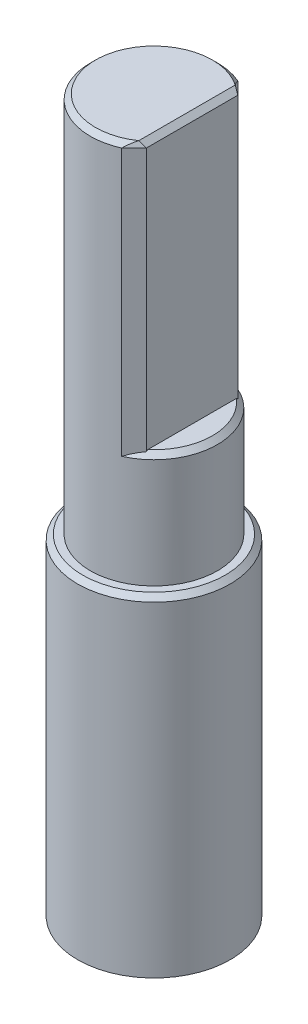
ISO-10303-21;
HEADER;
FILE_DESCRIPTION(('STEP AP214'),'2;1');
FILE_NAME('part.step','',(''),(''),'','','');
FILE_SCHEMA(('AUTOMOTIVE_DESIGN { 1 0 10303 214 1 1 1 1 }'));
ENDSEC;
DATA;
#1=APPLICATION_CONTEXT('core data for automotive mechanical design processes');
#2=APPLICATION_PROTOCOL_DEFINITION('international standard','automotive_design',2000,#1);
#3=PRODUCT_CONTEXT('',#1,'mechanical');
#4=PRODUCT('Part','Part','',(#3));
#5=PRODUCT_RELATED_PRODUCT_CATEGORY('part','',(#4));
#6=PRODUCT_DEFINITION_FORMATION('','',#4);
#7=PRODUCT_DEFINITION_CONTEXT('part definition',#1,'design');
#8=PRODUCT_DEFINITION('design','',#6,#7);
#9=PRODUCT_DEFINITION_SHAPE('','',#8);
#10=(LENGTH_UNIT() NAMED_UNIT(*) SI_UNIT(.MILLI.,.METRE.));
#11=(NAMED_UNIT(*) PLANE_ANGLE_UNIT() SI_UNIT($,.RADIAN.));
#12=(NAMED_UNIT(*) SI_UNIT($,.STERADIAN.) SOLID_ANGLE_UNIT());
#13=UNCERTAINTY_MEASURE_WITH_UNIT(LENGTH_MEASURE(1.E-05),#10,'distance_accuracy_value','');
#14=(GEOMETRIC_REPRESENTATION_CONTEXT(3) GLOBAL_UNCERTAINTY_ASSIGNED_CONTEXT((#13)) GLOBAL_UNIT_ASSIGNED_CONTEXT((#10,
#11,#12)) REPRESENTATION_CONTEXT('',''));
#15=CARTESIAN_POINT('',(0.,0.,0.));
#16=DIRECTION('',(0.,0.,1.));
#17=DIRECTION('',(1.,0.,0.));
#18=AXIS2_PLACEMENT_3D('',#15,#16,#17);
#19=CARTESIAN_POINT('',(0.,-10.,0.));
#20=DIRECTION('',(0.,1.,0.));
#21=DIRECTION('',(0.,0.,1.));
#22=AXIS2_PLACEMENT_3D('',#19,#20,#21);
#23=CYLINDRICAL_SURFACE('',#22,3.);
#24=CARTESIAN_POINT('',(0.,2.8,0.));
#25=DIRECTION('',(0.,1.,0.));
#26=DIRECTION('',(0.,0.,1.));
#27=AXIS2_PLACEMENT_3D('',#24,#25,#26);
#28=CIRCLE('',#27,3.);
#29=CARTESIAN_POINT('',(0.,2.8,3.));
#30=VERTEX_POINT('',#29);
#31=EDGE_CURVE('E105',#30,#30,#28,.F.);
#32=ORIENTED_EDGE('',*,*,#31,.T.);
#33=EDGE_LOOP('',(#32));
#34=FACE_BOUND('',#33,.T.);
#35=CARTESIAN_POINT('',(0.,-10.,0.));
#36=DIRECTION('',(0.,1.,0.));
#37=DIRECTION('',(0.,0.,1.));
#38=AXIS2_PLACEMENT_3D('',#35,#36,#37);
#39=CIRCLE('',#38,3.);
#40=CARTESIAN_POINT('',(0.,-10.,3.));
#41=VERTEX_POINT('',#40);
#42=EDGE_CURVE('E108',#41,#41,#39,.T.);
#43=ORIENTED_EDGE('',*,*,#42,.T.);
#44=EDGE_LOOP('',(#43));
#45=FACE_BOUND('',#44,.T.);
#46=ADVANCED_FACE('F32',(#34,#45),#23,.T.);
#47=CARTESIAN_POINT('',(0.,-10.,0.));
#48=DIRECTION('',(0.,1.,0.));
#49=DIRECTION('',(0.,0.,1.));
#50=AXIS2_PLACEMENT_3D('',#47,#48,#49);
#51=PLANE('',#50);
#52=ORIENTED_EDGE('',*,*,#42,.F.);
#53=EDGE_LOOP('',(#52));
#54=FACE_BOUND('',#53,.T.);
#55=ADVANCED_FACE('F221',(#54),#51,.F.);
#56=CARTESIAN_POINT('',(0.,3.,0.));
#57=DIRECTION('',(0.,1.,0.));
#58=DIRECTION('',(0.,0.,1.));
#59=AXIS2_PLACEMENT_3D('',#56,#57,#58);
#60=CYLINDRICAL_SURFACE('',#59,2.5);
#61=DIRECTION('',(0.,1.,0.));
#62=VECTOR('',#61,1.);
#63=CARTESIAN_POINT('',(1.01557112297752,3.,-2.28442887702248));
#64=LINE('',#63,#62);
#65=CARTESIAN_POINT('',(1.01557112297752,17.8,-2.28442887702248));
#66=VERTEX_POINT('',#65);
#67=CARTESIAN_POINT('',(1.01557112297752,7.3,-2.28442887702248));
#68=VERTEX_POINT('',#67);
#69=EDGE_CURVE('E124',#66,#68,#64,.F.);
#70=ORIENTED_EDGE('',*,*,#69,.T.);
#71=CARTESIAN_POINT('',(0.,7.3,0.));
#72=DIRECTION('',(0.,1.,0.));
#73=DIRECTION('',(0.,0.,1.));
#74=AXIS2_PLACEMENT_3D('',#71,#72,#73);
#75=CIRCLE('',#74,2.5);
#76=CARTESIAN_POINT('',(1.01557112297752,7.3,2.28442887702248));
#77=VERTEX_POINT('',#76);
#78=EDGE_CURVE('E126',#68,#77,#75,.F.);
#79=ORIENTED_EDGE('',*,*,#78,.T.);
#80=DIRECTION('',(0.,1.,0.));
#81=VECTOR('',#80,1.);
#82=CARTESIAN_POINT('',(1.01557112297752,3.,2.28442887702248));
#83=LINE('',#82,#81);
#84=CARTESIAN_POINT('',(1.01557112297752,17.8,2.28442887702248));
#85=VERTEX_POINT('',#84);
#86=EDGE_CURVE('E122',#77,#85,#83,.T.);
#87=ORIENTED_EDGE('',*,*,#86,.T.);
#88=CARTESIAN_POINT('',(0.,17.8,0.));
#89=DIRECTION('',(0.,1.,0.));
#90=DIRECTION('',(0.,0.,1.));
#91=AXIS2_PLACEMENT_3D('',#88,#89,#90);
#92=CIRCLE('',#91,2.5);
#93=EDGE_CURVE('E104',#85,#66,#92,.F.);
#94=ORIENTED_EDGE('',*,*,#93,.T.);
#95=EDGE_LOOP('',(#70,#79,#87,#94));
#96=FACE_BOUND('',#95,.T.);
#97=CARTESIAN_POINT('',(0.,3.,0.));
#98=DIRECTION('',(0.,1.,0.));
#99=DIRECTION('',(0.,0.,1.));
#100=AXIS2_PLACEMENT_3D('',#97,#98,#99);
#101=CIRCLE('',#100,2.5);
#102=CARTESIAN_POINT('',(0.,3.,2.5));
#103=VERTEX_POINT('',#102);
#104=EDGE_CURVE('E109',#103,#103,#101,.T.);
#105=ORIENTED_EDGE('',*,*,#104,.T.);
#106=EDGE_LOOP('',(#105));
#107=FACE_BOUND('',#106,.T.);
#108=ADVANCED_FACE('F226',(#96,#107),#60,.T.);
#109=CARTESIAN_POINT('',(0.,3.,0.));
#110=DIRECTION('',(0.,1.,0.));
#111=DIRECTION('',(0.,0.,1.));
#112=AXIS2_PLACEMENT_3D('',#109,#110,#111);
#113=PLANE('',#112);
#114=CARTESIAN_POINT('',(0.,3.,0.));
#115=DIRECTION('',(0.,1.,0.));
#116=DIRECTION('',(0.,0.,1.));
#117=AXIS2_PLACEMENT_3D('',#114,#115,#116);
#118=CIRCLE('',#117,2.8);
#119=CARTESIAN_POINT('',(0.,3.,2.8));
#120=VERTEX_POINT('',#119);
#121=EDGE_CURVE('E112',#120,#120,#118,.T.);
#122=ORIENTED_EDGE('',*,*,#121,.T.);
#123=EDGE_LOOP('',(#122));
#124=FACE_BOUND('',#123,.T.);
#125=ORIENTED_EDGE('',*,*,#104,.F.);
#126=EDGE_LOOP('',(#125));
#127=FACE_BOUND('',#126,.T.);
#128=ADVANCED_FACE('F234',(#124,#127),#113,.T.);
#129=CARTESIAN_POINT('',(0.,7.5,0.));
#130=DIRECTION('',(0.,1.,0.));
#131=DIRECTION('',(0.,0.,1.));
#132=AXIS2_PLACEMENT_3D('',#129,#130,#131);
#133=PLANE('',#132);
#134=DIRECTION('',(0.,0.,1.));
#135=VECTOR('',#134,1.);
#136=CARTESIAN_POINT('',(1.5,7.5,-3.));
#137=LINE('',#136,#135);
#138=CARTESIAN_POINT('',(1.5,7.5,-1.74355957741627));
#139=VERTEX_POINT('',#138);
#140=CARTESIAN_POINT('',(1.5,7.5,1.74355957741627));
#141=VERTEX_POINT('',#140);
#142=EDGE_CURVE('E103',#139,#141,#137,.T.);
#143=ORIENTED_EDGE('',*,*,#142,.T.);
#144=CARTESIAN_POINT('',(0.,7.5,0.));
#145=DIRECTION('',(0.,1.,0.));
#146=DIRECTION('',(0.,0.,1.));
#147=AXIS2_PLACEMENT_3D('',#144,#145,#146);
#148=CIRCLE('',#147,2.3);
#149=EDGE_CURVE('E94',#141,#139,#148,.T.);
#150=ORIENTED_EDGE('',*,*,#149,.T.);
#151=EDGE_LOOP('',(#143,#150));
#152=FACE_BOUND('',#151,.T.);
#153=ADVANCED_FACE('F102',(#152),#133,.T.);
#154=CARTESIAN_POINT('',(1.5,7.5,-3.));
#155=DIRECTION('',(-1.,0.,0.));
#156=DIRECTION('',(0.,0.,1.));
#157=AXIS2_PLACEMENT_3D('',#154,#155,#156);
#158=PLANE('',#157);
#159=CARTESIAN_POINT('',(1.5,7.5,-1.74355957741627));
#160=CARTESIAN_POINT('',(1.5,7.49285102019159,-1.75298934088291));
#161=CARTESIAN_POINT('',(1.5,7.48568695497038,-1.76240759127683));
#162=CARTESIAN_POINT('',(1.5,7.47132865404493,-1.78122106547032));
#163=CARTESIAN_POINT('',(1.5,7.46413441834213,-1.79061628927099));
#164=CARTESIAN_POINT('',(1.5,7.45692509722797,-1.80000000000004));
#165=B_SPLINE_CURVE_WITH_KNOTS('',3,(#159,#160,#161,#162,#163,#164),.UNSPECIFIED.,.F.,.F.,(4,2,
4),(0.,0.0354999357574972,0.0709998698209496),.UNSPECIFIED.);
#166=CARTESIAN_POINT('',(1.5,7.45692509722797,-1.80000000000004));
#167=VERTEX_POINT('',#166);
#168=EDGE_CURVE('E45',#139,#167,#165,.T.);
#169=ORIENTED_EDGE('',*,*,#168,.T.);
#170=DIRECTION('',(0.,1.,0.));
#171=VECTOR('',#170,1.);
#172=CARTESIAN_POINT('',(1.5,18.,-1.80000000000004));
#173=LINE('',#172,#171);
#174=CARTESIAN_POINT('',(1.5,17.8,-1.80000000000004));
#175=VERTEX_POINT('',#174);
#176=EDGE_CURVE('E60',#167,#175,#173,.T.);
#177=ORIENTED_EDGE('',*,*,#176,.T.);
#178=DIRECTION('',(0.,0.,1.));
#179=VECTOR('',#178,1.);
#180=CARTESIAN_POINT('',(1.5,17.8,2.));
#181=LINE('',#180,#179);
#182=CARTESIAN_POINT('',(1.5,17.8,1.80000000000004));
#183=VERTEX_POINT('',#182);
#184=EDGE_CURVE('E129',#175,#183,#181,.T.);
#185=ORIENTED_EDGE('',*,*,#184,.T.);
#186=DIRECTION('',(0.,-1.,0.));
#187=VECTOR('',#186,1.);
#188=CARTESIAN_POINT('',(1.5,7.5,1.80000000000004));
#189=LINE('',#188,#187);
#190=CARTESIAN_POINT('',(1.5,7.45692509722797,1.80000000000004));
#191=VERTEX_POINT('',#190);
#192=EDGE_CURVE('E52',#183,#191,#189,.T.);
#193=ORIENTED_EDGE('',*,*,#192,.T.);
#194=CARTESIAN_POINT('',(1.5,7.45692509722797,1.80000000000004));
#195=CARTESIAN_POINT('',(1.5,7.46413441834213,1.79061628927099));
#196=CARTESIAN_POINT('',(1.5,7.47132865404493,1.78122106547032));
#197=CARTESIAN_POINT('',(1.5,7.48568695497038,1.76240759127683));
#198=CARTESIAN_POINT('',(1.5,7.49285102019159,1.75298934088291));
#199=CARTESIAN_POINT('',(1.5,7.5,1.74355957741627));
#200=B_SPLINE_CURVE_WITH_KNOTS('',3,(#194,#195,#196,#197,#198,#199),.UNSPECIFIED.,.F.,.F.,(4,2,
4),(0.,0.0354999340634524,0.0709998698209498),.UNSPECIFIED.);
#201=EDGE_CURVE('E11',#191,#141,#200,.T.);
#202=ORIENTED_EDGE('',*,*,#201,.T.);
#203=ORIENTED_EDGE('',*,*,#142,.F.);
#204=EDGE_LOOP('',(#169,#177,#185,#193,#202,#203));
#205=FACE_BOUND('',#204,.T.);
#206=ADVANCED_FACE('F107',(#205),#158,.F.);
#207=CARTESIAN_POINT('',(0.,18.,0.));
#208=DIRECTION('',(0.,1.,0.));
#209=DIRECTION('',(0.,0.,1.));
#210=AXIS2_PLACEMENT_3D('',#207,#208,#209);
#211=PLANE('',#210);
#212=CARTESIAN_POINT('',(0.,18.,0.));
#213=DIRECTION('',(0.,1.,0.));
#214=DIRECTION('',(0.,0.,1.));
#215=AXIS2_PLACEMENT_3D('',#212,#213,#214);
#216=CIRCLE('',#215,2.3);
#217=CARTESIAN_POINT('',(1.29999999999999,18.,-1.89736659610104));
#218=VERTEX_POINT('',#217);
#219=CARTESIAN_POINT('',(1.29999999999999,18.,1.89736659610104));
#220=VERTEX_POINT('',#219);
#221=EDGE_CURVE('E133',#218,#220,#216,.T.);
#222=ORIENTED_EDGE('',*,*,#221,.T.);
#223=DIRECTION('',(0.,0.,-1.));
#224=VECTOR('',#223,1.);
#225=CARTESIAN_POINT('',(1.3,18.,-2.));
#226=LINE('',#225,#224);
#227=EDGE_CURVE('E98',#220,#218,#226,.T.);
#228=ORIENTED_EDGE('',*,*,#227,.T.);
#229=EDGE_LOOP('',(#222,#228));
#230=FACE_BOUND('',#229,.T.);
#231=ADVANCED_FACE('F212',(#230),#211,.T.);
#232=CARTESIAN_POINT('',(0.,3.,0.));
#233=DIRECTION('',(0.,-1.,0.));
#234=DIRECTION('',(0.,0.,-1.));
#235=AXIS2_PLACEMENT_3D('',#232,#233,#234);
#236=CONICAL_SURFACE('',#235,2.8,0.785398163397452);
#237=ORIENTED_EDGE('',*,*,#31,.F.);
#238=EDGE_LOOP('',(#237));
#239=FACE_BOUND('',#238,.T.);
#240=ORIENTED_EDGE('',*,*,#121,.F.);
#241=EDGE_LOOP('',(#240));
#242=FACE_BOUND('',#241,.T.);
#243=ADVANCED_FACE('F153',(#239,#242),#236,.T.);
#244=CARTESIAN_POINT('',(1.5,17.8,-3.));
#245=DIRECTION('',(0.707106781186545,0.70710678118655,0.));
#246=DIRECTION('',(0.,0.,-1.));
#247=AXIS2_PLACEMENT_3D('',#244,#245,#246);
#248=PLANE('',#247);
#249=DIRECTION('',(0.668600029572011,-0.668600029572006,0.325496545162339));
#250=VECTOR('',#249,1.);
#251=CARTESIAN_POINT('',(1.5,17.8,-1.80000000000004));
#252=LINE('',#251,#250);
#253=EDGE_CURVE('E189',#218,#175,#252,.T.);
#254=ORIENTED_EDGE('',*,*,#253,.F.);
#255=ORIENTED_EDGE('',*,*,#227,.F.);
#256=DIRECTION('',(-0.668600029572035,0.668600029572031,0.325496545162239));
#257=VECTOR('',#256,1.);
#258=CARTESIAN_POINT('',(1.17802289395654,18.1219771060435,1.95674907418953));
#259=LINE('',#258,#257);
#260=EDGE_CURVE('E192',#183,#220,#259,.T.);
#261=ORIENTED_EDGE('',*,*,#260,.F.);
#262=ORIENTED_EDGE('',*,*,#184,.F.);
#263=EDGE_LOOP('',(#254,#255,#261,#262));
#264=FACE_BOUND('',#263,.T.);
#265=ADVANCED_FACE('F34',(#264),#248,.T.);
#266=CARTESIAN_POINT('',(0.,18.,0.));
#267=DIRECTION('',(0.,-1.,0.));
#268=DIRECTION('',(0.,0.,-1.));
#269=AXIS2_PLACEMENT_3D('',#266,#267,#268);
#270=CONICAL_SURFACE('',#269,2.3,0.785398163397451);
#271=CARTESIAN_POINT('',(1.29999999999999,18.,1.89736659610104));
#272=CARTESIAN_POINT('',(1.27358480107502,17.9881006901367,1.92988812840262));
#273=CARTESIAN_POINT('',(1.24791377876603,17.9747155052516,1.96242798614447));
#274=CARTESIAN_POINT('',(1.19803029707093,17.9454582065731,2.0273253486009));
#275=CARTESIAN_POINT('',(1.17381338685574,17.9295942801266,2.0596831026681));
#276=CARTESIAN_POINT('',(1.12665130027284,17.895790573377,2.12419213669156));
#277=CARTESIAN_POINT('',(1.10370545850435,17.8778518946836,2.15634351673886));
#278=CARTESIAN_POINT('',(1.0588625554512,17.8401784718905,2.22051917788087));
#279=CARTESIAN_POINT('',(1.03696913768228,17.820438090413,2.25254270837631));
#280=CARTESIAN_POINT('',(1.01557112297752,17.8,2.28442887702248));
#281=B_SPLINE_CURVE_WITH_KNOTS('',3,(#271,#272,#273,#274,#275,#276,#277,#278,#279,#280),
.UNSPECIFIED.,.F.,.F.,(4,2,2,2,4),(0.,0.130586978509166,0.260751403967073,0.390847031935366,
0.521364668445721),.UNSPECIFIED.);
#282=EDGE_CURVE('E36',#220,#85,#281,.T.);
#283=ORIENTED_EDGE('',*,*,#282,.F.);
#284=ORIENTED_EDGE('',*,*,#221,.F.);
#285=CARTESIAN_POINT('',(1.01557112297752,17.8,-2.28442887702248));
#286=CARTESIAN_POINT('',(1.03696913768228,17.820438090413,-2.25254270837631));
#287=CARTESIAN_POINT('',(1.0588625554512,17.8401784718905,-2.22051917788088));
#288=CARTESIAN_POINT('',(1.10370545850436,17.8778518946835,-2.15634351673886));
#289=CARTESIAN_POINT('',(1.12665130027286,17.895790573377,-2.12419213669156));
#290=CARTESIAN_POINT('',(1.17381338685576,17.9295942801266,-2.05968310266811));
#291=CARTESIAN_POINT('',(1.19803029707096,17.945458206573,-2.02732534860091));
#292=CARTESIAN_POINT('',(1.24791377876606,17.9747155052516,-1.96242798614447));
#293=CARTESIAN_POINT('',(1.27358480107506,17.9881006901366,-1.92988812840263));
#294=CARTESIAN_POINT('',(1.30000000000003,18.,-1.89736659610105));
#295=B_SPLINE_CURVE_WITH_KNOTS('',3,(#285,#286,#287,#288,#289,#290,#291,#292,#293,#294),
.UNSPECIFIED.,.F.,.F.,(4,2,2,2,4),(0.,0.130517636510357,0.26061326447865,0.390777689936557,
0.521364668445726),.UNSPECIFIED.);
#296=EDGE_CURVE('E184',#66,#218,#295,.T.);
#297=ORIENTED_EDGE('',*,*,#296,.F.);
#298=ORIENTED_EDGE('',*,*,#93,.F.);
#299=EDGE_LOOP('',(#283,#284,#297,#298));
#300=FACE_BOUND('',#299,.T.);
#301=ADVANCED_FACE('F181',(#300),#270,.T.);
#302=CARTESIAN_POINT('',(1.01557112297752,17.8,2.28442887702248));
#303=DIRECTION('',(0.664699057853721,0.341101634379946,0.664699057853782));
#304=DIRECTION('',(0.70710678118658,0.,-0.707106781186515));
#305=AXIS2_PLACEMENT_3D('',#302,#303,#304);
#306=PLANE('',#305);
#307=ORIENTED_EDGE('',*,*,#260,.T.);
#308=ORIENTED_EDGE('',*,*,#282,.T.);
#309=DIRECTION('',(-0.70710678118658,0.,0.707106781186515));
#310=VECTOR('',#309,1.);
#311=CARTESIAN_POINT('',(1.01557112297752,17.8,2.28442887702248));
#312=LINE('',#311,#310);
#313=EDGE_CURVE('E190',#183,#85,#312,.T.);
#314=ORIENTED_EDGE('',*,*,#313,.F.);
#315=EDGE_LOOP('',(#307,#308,#314));
#316=FACE_BOUND('',#315,.T.);
#317=ADVANCED_FACE('F179',(#316),#306,.T.);
#318=CARTESIAN_POINT('',(1.5,17.8,-1.80000000000004));
#319=DIRECTION('',(0.664699057853746,0.341101634379849,-0.664699057853807));
#320=DIRECTION('',(-0.70710678118658,0.,-0.707106781186515));
#321=AXIS2_PLACEMENT_3D('',#318,#319,#320);
#322=PLANE('',#321);
#323=ORIENTED_EDGE('',*,*,#296,.T.);
#324=ORIENTED_EDGE('',*,*,#253,.T.);
#325=DIRECTION('',(-0.70710678118658,0.,-0.707106781186515));
#326=VECTOR('',#325,1.);
#327=CARTESIAN_POINT('',(1.5,17.8,-1.80000000000004));
#328=LINE('',#327,#326);
#329=EDGE_CURVE('E169',#66,#175,#328,.F.);
#330=ORIENTED_EDGE('',*,*,#329,.F.);
#331=EDGE_LOOP('',(#323,#324,#330));
#332=FACE_BOUND('',#331,.T.);
#333=ADVANCED_FACE('F175',(#332),#322,.T.);
#334=CARTESIAN_POINT('',(1.01557112297752,3.,2.28442887702248));
#335=DIRECTION('',(-0.707106781186515,0.,-0.70710678118658));
#336=DIRECTION('',(0.,1.,0.));
#337=AXIS2_PLACEMENT_3D('',#334,#335,#336);
#338=PLANE('',#337);
#339=ORIENTED_EDGE('',*,*,#313,.T.);
#340=ORIENTED_EDGE('',*,*,#86,.F.);
#341=CARTESIAN_POINT('',(1.01557112297752,7.3,2.28442887702248));
#342=CARTESIAN_POINT('',(1.05471781252222,7.31987137119307,2.24528218747778));
#343=CARTESIAN_POINT('',(1.09424125880928,7.33832619842485,2.20575874119072));
#344=CARTESIAN_POINT('',(1.17381152211071,7.37190590716679,2.1261884778893));
#345=CARTESIAN_POINT('',(1.21385555849709,7.38704402007375,2.08614444150293));
#346=CARTESIAN_POINT('',(1.29457461735103,7.41366795149379,2.005425382649));
#347=CARTESIAN_POINT('',(1.3352499188946,7.42515210342964,1.96475008110542));
#348=CARTESIAN_POINT('',(1.4172299300268,7.44414431464332,1.88277006997323));
#349=CARTESIAN_POINT('',(1.45853653066511,7.45163595807414,1.84146346933492));
#350=CARTESIAN_POINT('',(1.5,7.45692509722797,1.80000000000004));
#351=B_SPLINE_CURVE_WITH_KNOTS('',3,(#341,#342,#343,#344,#345,#346,#347,#348,#349,#350),
.UNSPECIFIED.,.F.,.F.,(4,2,2,2,4),(0.,0.176474521921406,0.352231668297729,0.528068863246124,
0.704623569830429),.UNSPECIFIED.);
#352=EDGE_CURVE('E164',#191,#77,#351,.F.);
#353=ORIENTED_EDGE('',*,*,#352,.F.);
#354=ORIENTED_EDGE('',*,*,#192,.F.);
#355=EDGE_LOOP('',(#339,#340,#353,#354));
#356=FACE_BOUND('',#355,.T.);
#357=ADVANCED_FACE('F171',(#356),#338,.F.);
#358=CARTESIAN_POINT('',(1.01557112297752,3.,-2.28442887702248));
#359=DIRECTION('',(0.707106781186515,0.,-0.70710678118658));
#360=DIRECTION('',(0.,1.,0.));
#361=AXIS2_PLACEMENT_3D('',#358,#359,#360);
#362=PLANE('',#361);
#363=ORIENTED_EDGE('',*,*,#176,.F.);
#364=CARTESIAN_POINT('',(1.5,7.45692509722797,-1.80000000000004));
#365=CARTESIAN_POINT('',(1.45853653066511,7.45163595807414,-1.84146346933492));
#366=CARTESIAN_POINT('',(1.4172299300268,7.44414431464332,-1.88277006997323));
#367=CARTESIAN_POINT('',(1.3352499188946,7.42515210342964,-1.96475008110542));
#368=CARTESIAN_POINT('',(1.29457461735103,7.41366795149379,-2.005425382649));
#369=CARTESIAN_POINT('',(1.21385555849709,7.38704402007375,-2.08614444150293));
#370=CARTESIAN_POINT('',(1.17381152211071,7.37190590716679,-2.1261884778893));
#371=CARTESIAN_POINT('',(1.09424125880928,7.33832619842485,-2.20575874119072));
#372=CARTESIAN_POINT('',(1.05471781252222,7.31987137119307,-2.24528218747778));
#373=CARTESIAN_POINT('',(1.01557112297752,7.3,-2.28442887702248));
#374=B_SPLINE_CURVE_WITH_KNOTS('',3,(#364,#365,#366,#367,#368,#369,#370,#371,#372,#373),
.UNSPECIFIED.,.F.,.F.,(4,2,2,2,4),(0.,0.176554706584304,0.352391901532699,0.528149047909023,
0.704623569830429),.UNSPECIFIED.);
#375=EDGE_CURVE('E96',#68,#167,#374,.F.);
#376=ORIENTED_EDGE('',*,*,#375,.F.);
#377=ORIENTED_EDGE('',*,*,#69,.F.);
#378=ORIENTED_EDGE('',*,*,#329,.T.);
#379=EDGE_LOOP('',(#363,#376,#377,#378));
#380=FACE_BOUND('',#379,.T.);
#381=ADVANCED_FACE('F152',(#380),#362,.T.);
#382=CARTESIAN_POINT('',(0.,7.5,0.));
#383=DIRECTION('',(0.,-1.,0.));
#384=DIRECTION('',(0.,0.,-1.));
#385=AXIS2_PLACEMENT_3D('',#382,#383,#384);
#386=CONICAL_SURFACE('',#385,2.3,0.785398163397449);
#387=ORIENTED_EDGE('',*,*,#352,.T.);
#388=ORIENTED_EDGE('',*,*,#78,.F.);
#389=ORIENTED_EDGE('',*,*,#375,.T.);
#390=ORIENTED_EDGE('',*,*,#168,.F.);
#391=ORIENTED_EDGE('',*,*,#149,.F.);
#392=ORIENTED_EDGE('',*,*,#201,.F.);
#393=EDGE_LOOP('',(#387,#388,#389,#390,#391,#392));
#394=FACE_BOUND('',#393,.T.);
#395=ADVANCED_FACE('F92',(#394),#386,.T.);
#396=CLOSED_SHELL('',(#46,#55,#108,#128,#153,#206,#231,#243,#265,#301,#317,#333,#357,#381,#395));
#397=MANIFOLD_SOLID_BREP('B2',#396);
#398=ADVANCED_BREP_SHAPE_REPRESENTATION('',(#18,#397),#14);
#399=SHAPE_DEFINITION_REPRESENTATION(#9,#398);
ENDSEC;
END-ISO-10303-21;
